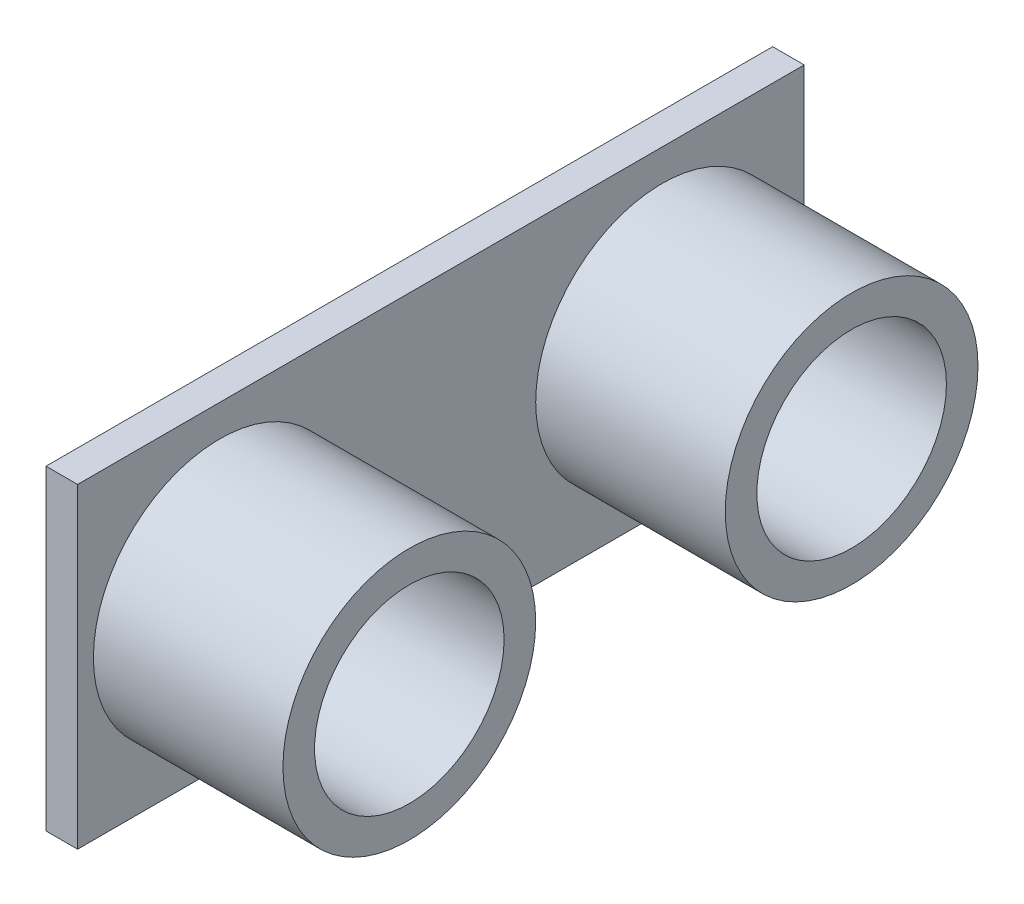
ISO-10303-21;
HEADER;
FILE_DESCRIPTION(('STEP AP214'),'2;1');
FILE_NAME('part.step','',(''),(''),'','','');
FILE_SCHEMA(('AUTOMOTIVE_DESIGN { 1 0 10303 214 1 1 1 1 }'));
ENDSEC;
DATA;
#1=APPLICATION_CONTEXT('core data for automotive mechanical design processes');
#2=APPLICATION_PROTOCOL_DEFINITION('international standard','automotive_design',2000,#1);
#3=PRODUCT_CONTEXT('',#1,'mechanical');
#4=PRODUCT('Part','Part','',(#3));
#5=PRODUCT_RELATED_PRODUCT_CATEGORY('part','',(#4));
#6=PRODUCT_DEFINITION_FORMATION('','',#4);
#7=PRODUCT_DEFINITION_CONTEXT('part definition',#1,'design');
#8=PRODUCT_DEFINITION('design','',#6,#7);
#9=PRODUCT_DEFINITION_SHAPE('','',#8);
#10=(LENGTH_UNIT() NAMED_UNIT(*) SI_UNIT(.MILLI.,.METRE.));
#11=(NAMED_UNIT(*) PLANE_ANGLE_UNIT() SI_UNIT($,.RADIAN.));
#12=(NAMED_UNIT(*) SI_UNIT($,.STERADIAN.) SOLID_ANGLE_UNIT());
#13=UNCERTAINTY_MEASURE_WITH_UNIT(LENGTH_MEASURE(1.E-05),#10,'distance_accuracy_value','');
#14=(GEOMETRIC_REPRESENTATION_CONTEXT(3) GLOBAL_UNCERTAINTY_ASSIGNED_CONTEXT((#13)) GLOBAL_UNIT_ASSIGNED_CONTEXT((#10,
#11,#12)) REPRESENTATION_CONTEXT('',''));
#15=CARTESIAN_POINT('',(0.,0.,0.));
#16=DIRECTION('',(0.,0.,1.));
#17=DIRECTION('',(1.,0.,0.));
#18=AXIS2_PLACEMENT_3D('',#15,#16,#17);
#19=CARTESIAN_POINT('',(1.,0.,0.));
#20=DIRECTION('',(0.,0.,-1.));
#21=DIRECTION('',(-1.,0.,0.));
#22=AXIS2_PLACEMENT_3D('',#19,#20,#21);
#23=PLANE('',#22);
#24=DIRECTION('',(0.,-1.,0.));
#25=VECTOR('',#24,1.);
#26=CARTESIAN_POINT('',(-1.,0.,0.));
#27=LINE('',#26,#25);
#28=CARTESIAN_POINT('',(-1.,20.,0.));
#29=VERTEX_POINT('',#28);
#30=CARTESIAN_POINT('',(-1.,0.,0.));
#31=VERTEX_POINT('',#30);
#32=EDGE_CURVE('E158',#29,#31,#27,.T.);
#33=ORIENTED_EDGE('',*,*,#32,.T.);
#34=DIRECTION('',(-1.,0.,0.));
#35=VECTOR('',#34,1.);
#36=CARTESIAN_POINT('',(1.,0.,0.));
#37=LINE('',#36,#35);
#38=CARTESIAN_POINT('',(1.,0.,0.));
#39=VERTEX_POINT('',#38);
#40=EDGE_CURVE('E196',#39,#31,#37,.T.);
#41=ORIENTED_EDGE('',*,*,#40,.F.);
#42=DIRECTION('',(0.,-1.,0.));
#43=VECTOR('',#42,1.);
#44=CARTESIAN_POINT('',(1.,0.,0.));
#45=LINE('',#44,#43);
#46=CARTESIAN_POINT('',(1.,20.,0.));
#47=VERTEX_POINT('',#46);
#48=EDGE_CURVE('E159',#47,#39,#45,.T.);
#49=ORIENTED_EDGE('',*,*,#48,.F.);
#50=DIRECTION('',(-1.,0.,0.));
#51=VECTOR('',#50,1.);
#52=CARTESIAN_POINT('',(1.,20.,0.));
#53=LINE('',#52,#51);
#54=EDGE_CURVE('E173',#47,#29,#53,.T.);
#55=ORIENTED_EDGE('',*,*,#54,.T.);
#56=EDGE_LOOP('',(#33,#41,#49,#55));
#57=FACE_BOUND('',#56,.T.);
#58=ADVANCED_FACE('F39',(#57),#23,.F.);
#59=CARTESIAN_POINT('',(1.,0.,0.));
#60=DIRECTION('',(0.,1.,0.));
#61=DIRECTION('',(0.,0.,1.));
#62=AXIS2_PLACEMENT_3D('',#59,#60,#61);
#63=PLANE('',#62);
#64=DIRECTION('',(0.,0.,-1.));
#65=VECTOR('',#64,1.);
#66=CARTESIAN_POINT('',(-1.,0.,0.));
#67=LINE('',#66,#65);
#68=CARTESIAN_POINT('',(-1.,0.,-19.5457269288065));
#69=VERTEX_POINT('',#68);
#70=EDGE_CURVE('E177',#31,#69,#67,.T.);
#71=ORIENTED_EDGE('',*,*,#70,.T.);
#72=DIRECTION('',(1.,0.,0.));
#73=VECTOR('',#72,1.);
#74=CARTESIAN_POINT('',(-6.,0.,-19.5457269288065));
#75=LINE('',#74,#73);
#76=CARTESIAN_POINT('',(-6.,0.,-19.5457269288065));
#77=VERTEX_POINT('',#76);
#78=EDGE_CURVE('E109',#77,#69,#75,.T.);
#79=ORIENTED_EDGE('',*,*,#78,.F.);
#80=DIRECTION('',(0.,0.,1.));
#81=VECTOR('',#80,1.);
#82=CARTESIAN_POINT('',(-6.,0.,-25.4273270230009));
#83=LINE('',#82,#81);
#84=CARTESIAN_POINT('',(-6.,0.,-25.4273270230009));
#85=VERTEX_POINT('',#84);
#86=EDGE_CURVE('E102',#85,#77,#83,.T.);
#87=ORIENTED_EDGE('',*,*,#86,.F.);
#88=DIRECTION('',(1.,0.,0.));
#89=VECTOR('',#88,1.);
#90=CARTESIAN_POINT('',(-6.,0.,-25.4273270230009));
#91=LINE('',#90,#89);
#92=CARTESIAN_POINT('',(-1.,0.,-25.4273270230009));
#93=VERTEX_POINT('',#92);
#94=EDGE_CURVE('E107',#85,#93,#91,.T.);
#95=ORIENTED_EDGE('',*,*,#94,.T.);
#96=CARTESIAN_POINT('',(-1.,0.,-46.));
#97=VERTEX_POINT('',#96);
#98=EDGE_CURVE('E59',#93,#97,#67,.T.);
#99=ORIENTED_EDGE('',*,*,#98,.T.);
#100=DIRECTION('',(-1.,0.,0.));
#101=VECTOR('',#100,1.);
#102=CARTESIAN_POINT('',(1.,0.,-46.));
#103=LINE('',#102,#101);
#104=CARTESIAN_POINT('',(1.,0.,-46.));
#105=VERTEX_POINT('',#104);
#106=EDGE_CURVE('E192',#105,#97,#103,.T.);
#107=ORIENTED_EDGE('',*,*,#106,.F.);
#108=DIRECTION('',(0.,0.,-1.));
#109=VECTOR('',#108,1.);
#110=CARTESIAN_POINT('',(1.,0.,0.));
#111=LINE('',#110,#109);
#112=EDGE_CURVE('E163',#39,#105,#111,.T.);
#113=ORIENTED_EDGE('',*,*,#112,.F.);
#114=ORIENTED_EDGE('',*,*,#40,.T.);
#115=EDGE_LOOP('',(#71,#79,#87,#95,#99,#107,#113,#114));
#116=FACE_BOUND('',#115,.T.);
#117=ADVANCED_FACE('F105',(#116),#63,.F.);
#118=CARTESIAN_POINT('',(1.,0.,-46.));
#119=DIRECTION('',(0.,0.,1.));
#120=DIRECTION('',(1.,0.,0.));
#121=AXIS2_PLACEMENT_3D('',#118,#119,#120);
#122=PLANE('',#121);
#123=DIRECTION('',(0.,1.,0.));
#124=VECTOR('',#123,1.);
#125=CARTESIAN_POINT('',(-1.,0.,-46.));
#126=LINE('',#125,#124);
#127=CARTESIAN_POINT('',(-1.,20.,-46.));
#128=VERTEX_POINT('',#127);
#129=EDGE_CURVE('E180',#97,#128,#126,.T.);
#130=ORIENTED_EDGE('',*,*,#129,.T.);
#131=DIRECTION('',(-1.,0.,0.));
#132=VECTOR('',#131,1.);
#133=CARTESIAN_POINT('',(1.,20.,-46.));
#134=LINE('',#133,#132);
#135=CARTESIAN_POINT('',(1.,20.,-46.));
#136=VERTEX_POINT('',#135);
#137=EDGE_CURVE('E188',#136,#128,#134,.T.);
#138=ORIENTED_EDGE('',*,*,#137,.F.);
#139=DIRECTION('',(0.,1.,0.));
#140=VECTOR('',#139,1.);
#141=CARTESIAN_POINT('',(1.,0.,-46.));
#142=LINE('',#141,#140);
#143=EDGE_CURVE('E167',#105,#136,#142,.T.);
#144=ORIENTED_EDGE('',*,*,#143,.F.);
#145=ORIENTED_EDGE('',*,*,#106,.T.);
#146=EDGE_LOOP('',(#130,#138,#144,#145));
#147=FACE_BOUND('',#146,.T.);
#148=ADVANCED_FACE('F224',(#147),#122,.F.);
#149=CARTESIAN_POINT('',(1.,20.,0.));
#150=DIRECTION('',(0.,-1.,0.));
#151=DIRECTION('',(0.,0.,-1.));
#152=AXIS2_PLACEMENT_3D('',#149,#150,#151);
#153=PLANE('',#152);
#154=DIRECTION('',(0.,0.,1.));
#155=VECTOR('',#154,1.);
#156=CARTESIAN_POINT('',(-1.,20.,0.));
#157=LINE('',#156,#155);
#158=EDGE_CURVE('E164',#128,#29,#157,.T.);
#159=ORIENTED_EDGE('',*,*,#158,.T.);
#160=ORIENTED_EDGE('',*,*,#54,.F.);
#161=DIRECTION('',(0.,0.,1.));
#162=VECTOR('',#161,1.);
#163=CARTESIAN_POINT('',(1.,20.,0.));
#164=LINE('',#163,#162);
#165=EDGE_CURVE('E170',#136,#47,#164,.T.);
#166=ORIENTED_EDGE('',*,*,#165,.F.);
#167=ORIENTED_EDGE('',*,*,#137,.T.);
#168=EDGE_LOOP('',(#159,#160,#166,#167));
#169=FACE_BOUND('',#168,.T.);
#170=ADVANCED_FACE('F209',(#169),#153,.F.);
#171=CARTESIAN_POINT('',(1.,0.,0.));
#172=DIRECTION('',(-1.,0.,0.));
#173=DIRECTION('',(0.,0.,1.));
#174=AXIS2_PLACEMENT_3D('',#171,#172,#173);
#175=PLANE('',#174);
#176=CARTESIAN_POINT('',(1.,10.,-37.));
#177=DIRECTION('',(-1.,0.,0.));
#178=DIRECTION('',(0.,0.,1.));
#179=AXIS2_PLACEMENT_3D('',#176,#177,#178);
#180=CIRCLE('',#179,8.);
#181=CARTESIAN_POINT('',(1.,10.,-29.));
#182=VERTEX_POINT('',#181);
#183=EDGE_CURVE('E11',#182,#182,#180,.F.);
#184=ORIENTED_EDGE('',*,*,#183,.F.);
#185=EDGE_LOOP('',(#184));
#186=FACE_BOUND('',#185,.T.);
#187=CARTESIAN_POINT('',(1.,10.,-9.));
#188=DIRECTION('',(-1.,0.,0.));
#189=DIRECTION('',(0.,0.,1.));
#190=AXIS2_PLACEMENT_3D('',#187,#188,#189);
#191=CIRCLE('',#190,8.);
#192=CARTESIAN_POINT('',(1.,10.,-0.999999999999996));
#193=VERTEX_POINT('',#192);
#194=EDGE_CURVE('E47',#193,#193,#191,.F.);
#195=ORIENTED_EDGE('',*,*,#194,.F.);
#196=EDGE_LOOP('',(#195));
#197=FACE_BOUND('',#196,.T.);
#198=ORIENTED_EDGE('',*,*,#48,.T.);
#199=ORIENTED_EDGE('',*,*,#112,.T.);
#200=ORIENTED_EDGE('',*,*,#143,.T.);
#201=ORIENTED_EDGE('',*,*,#165,.T.);
#202=EDGE_LOOP('',(#198,#199,#200,#201));
#203=FACE_BOUND('',#202,.T.);
#204=ADVANCED_FACE('F205',(#186,#197,#203),#175,.F.);
#205=CARTESIAN_POINT('',(-1.,0.,0.));
#206=DIRECTION('',(-1.,0.,0.));
#207=DIRECTION('',(0.,0.,1.));
#208=AXIS2_PLACEMENT_3D('',#205,#206,#207);
#209=PLANE('',#208);
#210=DIRECTION('',(0.,-1.,0.));
#211=VECTOR('',#210,1.);
#212=CARTESIAN_POINT('',(-1.,1.44706034063513,-25.4273270230009));
#213=LINE('',#212,#211);
#214=CARTESIAN_POINT('',(-1.,1.44706034063513,-25.4273270230009));
#215=VERTEX_POINT('',#214);
#216=EDGE_CURVE('E54',#215,#93,#213,.T.);
#217=ORIENTED_EDGE('',*,*,#216,.F.);
#218=DIRECTION('',(0.,0.,-1.));
#219=VECTOR('',#218,1.);
#220=CARTESIAN_POINT('',(-1.,1.44706034063513,-25.4273270230009));
#221=LINE('',#220,#219);
#222=CARTESIAN_POINT('',(-1.,1.44706034063513,-19.5457269288065));
#223=VERTEX_POINT('',#222);
#224=EDGE_CURVE('E124',#223,#215,#221,.T.);
#225=ORIENTED_EDGE('',*,*,#224,.F.);
#226=DIRECTION('',(0.,1.,0.));
#227=VECTOR('',#226,1.);
#228=CARTESIAN_POINT('',(-1.,1.44706034063513,-19.5457269288065));
#229=LINE('',#228,#227);
#230=EDGE_CURVE('E228',#69,#223,#229,.T.);
#231=ORIENTED_EDGE('',*,*,#230,.F.);
#232=ORIENTED_EDGE('',*,*,#70,.F.);
#233=ORIENTED_EDGE('',*,*,#32,.F.);
#234=ORIENTED_EDGE('',*,*,#158,.F.);
#235=ORIENTED_EDGE('',*,*,#129,.F.);
#236=ORIENTED_EDGE('',*,*,#98,.F.);
#237=EDGE_LOOP('',(#217,#225,#231,#232,#233,#234,#235,#236));
#238=FACE_BOUND('',#237,.T.);
#239=ADVANCED_FACE('F208',(#238),#209,.T.);
#240=CARTESIAN_POINT('',(13.,10.,-9.));
#241=DIRECTION('',(1.,0.,0.));
#242=DIRECTION('',(0.,0.,-1.));
#243=AXIS2_PLACEMENT_3D('',#240,#241,#242);
#244=PLANE('',#243);
#245=CARTESIAN_POINT('',(13.,10.,-9.));
#246=DIRECTION('',(1.,0.,0.));
#247=DIRECTION('',(0.,0.,-1.));
#248=AXIS2_PLACEMENT_3D('',#245,#246,#247);
#249=CIRCLE('',#248,8.);
#250=CARTESIAN_POINT('',(13.,10.,-17.));
#251=VERTEX_POINT('',#250);
#252=EDGE_CURVE('E151',#251,#251,#249,.T.);
#253=ORIENTED_EDGE('',*,*,#252,.T.);
#254=EDGE_LOOP('',(#253));
#255=FACE_BOUND('',#254,.T.);
#256=CARTESIAN_POINT('',(13.,10.,-9.));
#257=DIRECTION('',(1.,0.,0.));
#258=DIRECTION('',(0.,0.,-1.));
#259=AXIS2_PLACEMENT_3D('',#256,#257,#258);
#260=CIRCLE('',#259,6.);
#261=CARTESIAN_POINT('',(13.,10.,-15.));
#262=VERTEX_POINT('',#261);
#263=EDGE_CURVE('E147',#262,#262,#260,.T.);
#264=ORIENTED_EDGE('',*,*,#263,.F.);
#265=EDGE_LOOP('',(#264));
#266=FACE_BOUND('',#265,.T.);
#267=ADVANCED_FACE('F269',(#255,#266),#244,.T.);
#268=CARTESIAN_POINT('',(13.,10.,-9.));
#269=DIRECTION('',(-1.,0.,0.));
#270=DIRECTION('',(0.,0.,1.));
#271=AXIS2_PLACEMENT_3D('',#268,#269,#270);
#272=CYLINDRICAL_SURFACE('',#271,8.);
#273=ORIENTED_EDGE('',*,*,#252,.F.);
#274=EDGE_LOOP('',(#273));
#275=FACE_BOUND('',#274,.T.);
#276=ORIENTED_EDGE('',*,*,#194,.T.);
#277=EDGE_LOOP('',(#276));
#278=FACE_BOUND('',#277,.T.);
#279=ADVANCED_FACE('F203',(#275,#278),#272,.T.);
#280=CARTESIAN_POINT('',(13.,10.,-9.));
#281=DIRECTION('',(-1.,0.,0.));
#282=DIRECTION('',(0.,0.,1.));
#283=AXIS2_PLACEMENT_3D('',#280,#281,#282);
#284=CYLINDRICAL_SURFACE('',#283,6.);
#285=ORIENTED_EDGE('',*,*,#263,.T.);
#286=EDGE_LOOP('',(#285));
#287=FACE_BOUND('',#286,.T.);
#288=CARTESIAN_POINT('',(1.,10.,-9.));
#289=DIRECTION('',(1.,0.,0.));
#290=DIRECTION('',(0.,0.,-1.));
#291=AXIS2_PLACEMENT_3D('',#288,#289,#290);
#292=CIRCLE('',#291,6.);
#293=CARTESIAN_POINT('',(1.,10.,-15.));
#294=VERTEX_POINT('',#293);
#295=EDGE_CURVE('E146',#294,#294,#292,.T.);
#296=ORIENTED_EDGE('',*,*,#295,.F.);
#297=EDGE_LOOP('',(#296));
#298=FACE_BOUND('',#297,.T.);
#299=ADVANCED_FACE('F273',(#287,#298),#284,.F.);
#300=ORIENTED_EDGE('',*,*,#295,.T.);
#301=EDGE_LOOP('',(#300));
#302=FACE_BOUND('',#301,.T.);
#303=ADVANCED_FACE('F213',(#302),#175,.F.);
#304=CARTESIAN_POINT('',(13.,10.,-37.));
#305=DIRECTION('',(1.,0.,0.));
#306=DIRECTION('',(0.,0.,-1.));
#307=AXIS2_PLACEMENT_3D('',#304,#305,#306);
#308=PLANE('',#307);
#309=CARTESIAN_POINT('',(13.,10.,-37.));
#310=DIRECTION('',(1.,0.,0.));
#311=DIRECTION('',(0.,0.,-1.));
#312=AXIS2_PLACEMENT_3D('',#309,#310,#311);
#313=CIRCLE('',#312,8.);
#314=CARTESIAN_POINT('',(13.,10.,-45.));
#315=VERTEX_POINT('',#314);
#316=EDGE_CURVE('E141',#315,#315,#313,.T.);
#317=ORIENTED_EDGE('',*,*,#316,.T.);
#318=EDGE_LOOP('',(#317));
#319=FACE_BOUND('',#318,.T.);
#320=CARTESIAN_POINT('',(13.,10.,-37.));
#321=DIRECTION('',(1.,0.,0.));
#322=DIRECTION('',(0.,0.,-1.));
#323=AXIS2_PLACEMENT_3D('',#320,#321,#322);
#324=CIRCLE('',#323,5.99999999999999);
#325=CARTESIAN_POINT('',(13.,10.,-43.));
#326=VERTEX_POINT('',#325);
#327=EDGE_CURVE('E133',#326,#326,#324,.T.);
#328=ORIENTED_EDGE('',*,*,#327,.F.);
#329=EDGE_LOOP('',(#328));
#330=FACE_BOUND('',#329,.T.);
#331=ADVANCED_FACE('F285',(#319,#330),#308,.T.);
#332=CARTESIAN_POINT('',(13.,10.,-37.));
#333=DIRECTION('',(-1.,0.,0.));
#334=DIRECTION('',(0.,0.,1.));
#335=AXIS2_PLACEMENT_3D('',#332,#333,#334);
#336=CYLINDRICAL_SURFACE('',#335,8.);
#337=ORIENTED_EDGE('',*,*,#316,.F.);
#338=EDGE_LOOP('',(#337));
#339=FACE_BOUND('',#338,.T.);
#340=ORIENTED_EDGE('',*,*,#183,.T.);
#341=EDGE_LOOP('',(#340));
#342=FACE_BOUND('',#341,.T.);
#343=ADVANCED_FACE('F281',(#339,#342),#336,.T.);
#344=CARTESIAN_POINT('',(13.,10.,-37.));
#345=DIRECTION('',(-1.,0.,0.));
#346=DIRECTION('',(0.,0.,1.));
#347=AXIS2_PLACEMENT_3D('',#344,#345,#346);
#348=CYLINDRICAL_SURFACE('',#347,5.99999999999999);
#349=ORIENTED_EDGE('',*,*,#327,.T.);
#350=EDGE_LOOP('',(#349));
#351=FACE_BOUND('',#350,.T.);
#352=CARTESIAN_POINT('',(1.,10.,-37.));
#353=DIRECTION('',(1.,0.,0.));
#354=DIRECTION('',(0.,0.,-1.));
#355=AXIS2_PLACEMENT_3D('',#352,#353,#354);
#356=CIRCLE('',#355,5.99999999999999);
#357=CARTESIAN_POINT('',(1.,10.,-43.));
#358=VERTEX_POINT('',#357);
#359=EDGE_CURVE('E128',#358,#358,#356,.T.);
#360=ORIENTED_EDGE('',*,*,#359,.F.);
#361=EDGE_LOOP('',(#360));
#362=FACE_BOUND('',#361,.T.);
#363=ADVANCED_FACE('F284',(#351,#362),#348,.F.);
#364=ORIENTED_EDGE('',*,*,#359,.T.);
#365=EDGE_LOOP('',(#364));
#366=FACE_BOUND('',#365,.T.);
#367=ADVANCED_FACE('F212',(#366),#175,.F.);
#368=CARTESIAN_POINT('',(-6.,1.44706034063513,-25.4273270230009));
#369=DIRECTION('',(0.,0.,1.));
#370=DIRECTION('',(1.,0.,0.));
#371=AXIS2_PLACEMENT_3D('',#368,#369,#370);
#372=PLANE('',#371);
#373=ORIENTED_EDGE('',*,*,#216,.T.);
#374=ORIENTED_EDGE('',*,*,#94,.F.);
#375=DIRECTION('',(0.,-1.,0.));
#376=VECTOR('',#375,1.);
#377=CARTESIAN_POINT('',(-6.,1.44706034063513,-25.4273270230009));
#378=LINE('',#377,#376);
#379=CARTESIAN_POINT('',(-6.,1.44706034063513,-25.4273270230009));
#380=VERTEX_POINT('',#379);
#381=EDGE_CURVE('E114',#380,#85,#378,.T.);
#382=ORIENTED_EDGE('',*,*,#381,.F.);
#383=DIRECTION('',(1.,0.,0.));
#384=VECTOR('',#383,1.);
#385=CARTESIAN_POINT('',(-6.,1.44706034063513,-25.4273270230009));
#386=LINE('',#385,#384);
#387=EDGE_CURVE('E240',#380,#215,#386,.T.);
#388=ORIENTED_EDGE('',*,*,#387,.T.);
#389=EDGE_LOOP('',(#373,#374,#382,#388));
#390=FACE_BOUND('',#389,.T.);
#391=ADVANCED_FACE('F126',(#390),#372,.F.);
#392=CARTESIAN_POINT('',(-6.,1.44706034063513,-19.5457269288065));
#393=DIRECTION('',(0.,0.,-1.));
#394=DIRECTION('',(-1.,0.,0.));
#395=AXIS2_PLACEMENT_3D('',#392,#393,#394);
#396=PLANE('',#395);
#397=ORIENTED_EDGE('',*,*,#230,.T.);
#398=DIRECTION('',(1.,0.,0.));
#399=VECTOR('',#398,1.);
#400=CARTESIAN_POINT('',(-6.,1.44706034063513,-19.5457269288065));
#401=LINE('',#400,#399);
#402=CARTESIAN_POINT('',(-6.,1.44706034063513,-19.5457269288065));
#403=VERTEX_POINT('',#402);
#404=EDGE_CURVE('E135',#403,#223,#401,.T.);
#405=ORIENTED_EDGE('',*,*,#404,.F.);
#406=DIRECTION('',(0.,1.,0.));
#407=VECTOR('',#406,1.);
#408=CARTESIAN_POINT('',(-6.,1.44706034063513,-19.5457269288065));
#409=LINE('',#408,#407);
#410=EDGE_CURVE('E113',#77,#403,#409,.T.);
#411=ORIENTED_EDGE('',*,*,#410,.F.);
#412=ORIENTED_EDGE('',*,*,#78,.T.);
#413=EDGE_LOOP('',(#397,#405,#411,#412));
#414=FACE_BOUND('',#413,.T.);
#415=ADVANCED_FACE('F245',(#414),#396,.F.);
#416=CARTESIAN_POINT('',(-6.,1.44706034063513,-25.4273270230009));
#417=DIRECTION('',(0.,-1.,0.));
#418=DIRECTION('',(0.,0.,-1.));
#419=AXIS2_PLACEMENT_3D('',#416,#417,#418);
#420=PLANE('',#419);
#421=ORIENTED_EDGE('',*,*,#224,.T.);
#422=ORIENTED_EDGE('',*,*,#387,.F.);
#423=DIRECTION('',(0.,0.,-1.));
#424=VECTOR('',#423,1.);
#425=CARTESIAN_POINT('',(-6.,1.44706034063513,-25.4273270230009));
#426=LINE('',#425,#424);
#427=EDGE_CURVE('E119',#403,#380,#426,.T.);
#428=ORIENTED_EDGE('',*,*,#427,.F.);
#429=ORIENTED_EDGE('',*,*,#404,.T.);
#430=EDGE_LOOP('',(#421,#422,#428,#429));
#431=FACE_BOUND('',#430,.T.);
#432=ADVANCED_FACE('F244',(#431),#420,.F.);
#433=CARTESIAN_POINT('',(-6.,0.,0.));
#434=DIRECTION('',(-1.,0.,0.));
#435=DIRECTION('',(0.,0.,1.));
#436=AXIS2_PLACEMENT_3D('',#433,#434,#435);
#437=PLANE('',#436);
#438=ORIENTED_EDGE('',*,*,#381,.T.);
#439=ORIENTED_EDGE('',*,*,#86,.T.);
#440=ORIENTED_EDGE('',*,*,#410,.T.);
#441=ORIENTED_EDGE('',*,*,#427,.T.);
#442=EDGE_LOOP('',(#438,#439,#440,#441));
#443=FACE_BOUND('',#442,.T.);
#444=ADVANCED_FACE('F117',(#443),#437,.T.);
#445=CLOSED_SHELL('',(#58,#117,#148,#170,#204,#239,#267,#279,#299,#303,#331,#343,#363,#367,#391,
#415,#432,#444));
#446=MANIFOLD_SOLID_BREP('B2',#445);
#447=ADVANCED_BREP_SHAPE_REPRESENTATION('',(#18,#446),#14);
#448=SHAPE_DEFINITION_REPRESENTATION(#9,#447);
ENDSEC;
END-ISO-10303-21;
